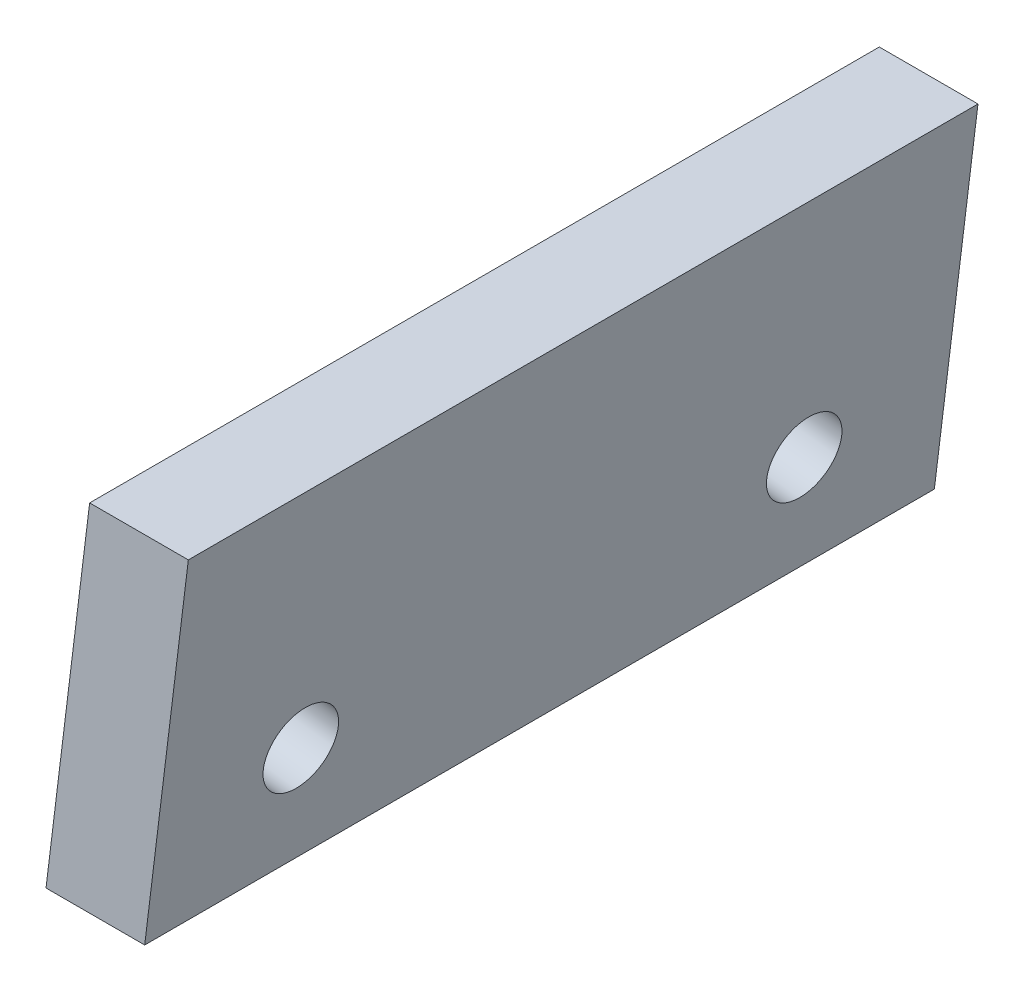
ISO-10303-21;
HEADER;
FILE_DESCRIPTION(('STEP AP214'),'2;1');
FILE_NAME('part.step','',(''),(''),'','','');
FILE_SCHEMA(('AUTOMOTIVE_DESIGN { 1 0 10303 214 1 1 1 1 }'));
ENDSEC;
DATA;
#1=APPLICATION_CONTEXT('core data for automotive mechanical design processes');
#2=APPLICATION_PROTOCOL_DEFINITION('international standard','automotive_design',2000,#1);
#3=PRODUCT_CONTEXT('',#1,'mechanical');
#4=PRODUCT('Part','Part','',(#3));
#5=PRODUCT_RELATED_PRODUCT_CATEGORY('part','',(#4));
#6=PRODUCT_DEFINITION_FORMATION('','',#4);
#7=PRODUCT_DEFINITION_CONTEXT('part definition',#1,'design');
#8=PRODUCT_DEFINITION('design','',#6,#7);
#9=PRODUCT_DEFINITION_SHAPE('','',#8);
#10=(LENGTH_UNIT() NAMED_UNIT(*) SI_UNIT(.MILLI.,.METRE.));
#11=(NAMED_UNIT(*) PLANE_ANGLE_UNIT() SI_UNIT($,.RADIAN.));
#12=(NAMED_UNIT(*) SI_UNIT($,.STERADIAN.) SOLID_ANGLE_UNIT());
#13=UNCERTAINTY_MEASURE_WITH_UNIT(LENGTH_MEASURE(1.E-05),#10,'distance_accuracy_value','');
#14=(GEOMETRIC_REPRESENTATION_CONTEXT(3) GLOBAL_UNCERTAINTY_ASSIGNED_CONTEXT((#13)) GLOBAL_UNIT_ASSIGNED_CONTEXT((#10,
#11,#12)) REPRESENTATION_CONTEXT('',''));
#15=CARTESIAN_POINT('',(0.,0.,0.));
#16=DIRECTION('',(0.,0.,1.));
#17=DIRECTION('',(1.,0.,0.));
#18=AXIS2_PLACEMENT_3D('',#15,#16,#17);
#19=CARTESIAN_POINT('',(0.,0.,20.));
#20=DIRECTION('',(0.992546151641322,-0.121869343405144,0.));
#21=DIRECTION('',(0.121869343405144,0.992546151641322,0.));
#22=AXIS2_PLACEMENT_3D('',#19,#20,#21);
#23=PLANE('',#22);
#24=CARTESIAN_POINT('',(0.365608030215432,2.97763845492397,3.625));
#25=DIRECTION('',(-0.992546151641322,0.121869343405144,0.));
#26=DIRECTION('',(-0.121869343405144,-0.992546151641322,0.));
#27=AXIS2_PLACEMENT_3D('',#24,#25,#26);
#28=CIRCLE('',#27,0.95);
#29=CARTESIAN_POINT('',(0.249832153980546,2.03471961086471,3.625));
#30=VERTEX_POINT('',#29);
#31=EDGE_CURVE('E108',#30,#30,#28,.T.);
#32=ORIENTED_EDGE('',*,*,#31,.F.);
#33=EDGE_LOOP('',(#32));
#34=FACE_BOUND('',#33,.T.);
#35=CARTESIAN_POINT('',(0.365608030215432,2.97763845492397,16.375));
#36=DIRECTION('',(-0.992546151641322,0.121869343405144,0.));
#37=DIRECTION('',(-0.121869343405144,-0.992546151641322,0.));
#38=AXIS2_PLACEMENT_3D('',#35,#36,#37);
#39=CIRCLE('',#38,0.950000000000001);
#40=CARTESIAN_POINT('',(0.249832153980545,2.03471961086471,16.375));
#41=VERTEX_POINT('',#40);
#42=EDGE_CURVE('E113',#41,#41,#39,.T.);
#43=ORIENTED_EDGE('',*,*,#42,.F.);
#44=EDGE_LOOP('',(#43));
#45=FACE_BOUND('',#44,.T.);
#46=DIRECTION('',(-0.121869343405144,-0.992546151641322,0.));
#47=VECTOR('',#46,1.);
#48=CARTESIAN_POINT('',(0.,0.,0.));
#49=LINE('',#48,#47);
#50=CARTESIAN_POINT('',(1.10506104812611,9.,0.));
#51=VERTEX_POINT('',#50);
#52=CARTESIAN_POINT('',(0.,0.,0.));
#53=VERTEX_POINT('',#52);
#54=EDGE_CURVE('E99',#51,#53,#49,.T.);
#55=ORIENTED_EDGE('',*,*,#54,.T.);
#56=DIRECTION('',(0.,0.,-1.));
#57=VECTOR('',#56,1.);
#58=CARTESIAN_POINT('',(0.,0.,20.));
#59=LINE('',#58,#57);
#60=CARTESIAN_POINT('',(0.,0.,20.));
#61=VERTEX_POINT('',#60);
#62=EDGE_CURVE('E11',#61,#53,#59,.T.);
#63=ORIENTED_EDGE('',*,*,#62,.F.);
#64=DIRECTION('',(-0.121869343405144,-0.992546151641322,0.));
#65=VECTOR('',#64,1.);
#66=CARTESIAN_POINT('',(0.,0.,20.));
#67=LINE('',#66,#65);
#68=CARTESIAN_POINT('',(1.10506104812611,9.,20.));
#69=VERTEX_POINT('',#68);
#70=EDGE_CURVE('E86',#69,#61,#67,.T.);
#71=ORIENTED_EDGE('',*,*,#70,.F.);
#72=DIRECTION('',(0.,0.,-1.));
#73=VECTOR('',#72,1.);
#74=CARTESIAN_POINT('',(1.10506104812611,9.,20.));
#75=LINE('',#74,#73);
#76=EDGE_CURVE('E95',#69,#51,#75,.T.);
#77=ORIENTED_EDGE('',*,*,#76,.T.);
#78=EDGE_LOOP('',(#55,#63,#71,#77));
#79=FACE_BOUND('',#78,.T.);
#80=ADVANCED_FACE('F33',(#34,#45,#79),#23,.F.);
#81=CARTESIAN_POINT('',(0.,0.,20.));
#82=DIRECTION('',(0.,1.,0.));
#83=DIRECTION('',(0.,0.,1.));
#84=AXIS2_PLACEMENT_3D('',#81,#82,#83);
#85=PLANE('',#84);
#86=DIRECTION('',(1.,0.,0.));
#87=VECTOR('',#86,1.);
#88=CARTESIAN_POINT('',(0.,0.,0.));
#89=LINE('',#88,#87);
#90=CARTESIAN_POINT('',(2.5,0.,0.));
#91=VERTEX_POINT('',#90);
#92=EDGE_CURVE('E90',#53,#91,#89,.T.);
#93=ORIENTED_EDGE('',*,*,#92,.T.);
#94=DIRECTION('',(0.,0.,-1.));
#95=VECTOR('',#94,1.);
#96=CARTESIAN_POINT('',(2.5,0.,20.));
#97=LINE('',#96,#95);
#98=CARTESIAN_POINT('',(2.5,0.,20.));
#99=VERTEX_POINT('',#98);
#100=EDGE_CURVE('E42',#99,#91,#97,.T.);
#101=ORIENTED_EDGE('',*,*,#100,.F.);
#102=DIRECTION('',(1.,0.,0.));
#103=VECTOR('',#102,1.);
#104=CARTESIAN_POINT('',(0.,0.,20.));
#105=LINE('',#104,#103);
#106=EDGE_CURVE('E81',#61,#99,#105,.T.);
#107=ORIENTED_EDGE('',*,*,#106,.F.);
#108=ORIENTED_EDGE('',*,*,#62,.T.);
#109=EDGE_LOOP('',(#93,#101,#107,#108));
#110=FACE_BOUND('',#109,.T.);
#111=ADVANCED_FACE('F89',(#110),#85,.F.);
#112=CARTESIAN_POINT('',(2.5,0.,20.));
#113=DIRECTION('',(-0.992546151641323,0.121869343405144,0.));
#114=DIRECTION('',(-0.121869343405144,-0.992546151641323,0.));
#115=AXIS2_PLACEMENT_3D('',#112,#113,#114);
#116=PLANE('',#115);
#117=CARTESIAN_POINT('',(2.82847768806043,2.67523608542439,3.625));
#118=DIRECTION('',(-0.992546151641323,0.121869343405144,0.));
#119=DIRECTION('',(-0.121869343405144,-0.992546151641323,0.));
#120=AXIS2_PLACEMENT_3D('',#117,#118,#119);
#121=CIRCLE('',#120,0.95);
#122=CARTESIAN_POINT('',(2.71270181182554,1.73231724136513,3.625));
#123=VERTEX_POINT('',#122);
#124=EDGE_CURVE('E36',#123,#123,#121,.T.);
#125=ORIENTED_EDGE('',*,*,#124,.T.);
#126=EDGE_LOOP('',(#125));
#127=FACE_BOUND('',#126,.T.);
#128=CARTESIAN_POINT('',(2.82847768806043,2.67523608542439,16.375));
#129=DIRECTION('',(-0.992546151641323,0.121869343405144,0.));
#130=DIRECTION('',(-0.121869343405144,-0.992546151641323,0.));
#131=AXIS2_PLACEMENT_3D('',#128,#129,#130);
#132=CIRCLE('',#131,0.950000000000001);
#133=CARTESIAN_POINT('',(2.71270181182554,1.73231724136513,16.375));
#134=VERTEX_POINT('',#133);
#135=EDGE_CURVE('E106',#134,#134,#132,.T.);
#136=ORIENTED_EDGE('',*,*,#135,.T.);
#137=EDGE_LOOP('',(#136));
#138=FACE_BOUND('',#137,.T.);
#139=DIRECTION('',(0.121869343405144,0.992546151641323,0.));
#140=VECTOR('',#139,1.);
#141=CARTESIAN_POINT('',(2.5,0.,0.));
#142=LINE('',#141,#140);
#143=CARTESIAN_POINT('',(3.60506104812611,9.,0.));
#144=VERTEX_POINT('',#143);
#145=EDGE_CURVE('E68',#91,#144,#142,.T.);
#146=ORIENTED_EDGE('',*,*,#145,.T.);
#147=DIRECTION('',(0.,0.,-1.));
#148=VECTOR('',#147,1.);
#149=CARTESIAN_POINT('',(3.60506104812611,9.,20.));
#150=LINE('',#149,#148);
#151=CARTESIAN_POINT('',(3.60506104812611,9.,20.));
#152=VERTEX_POINT('',#151);
#153=EDGE_CURVE('E91',#152,#144,#150,.T.);
#154=ORIENTED_EDGE('',*,*,#153,.F.);
#155=DIRECTION('',(0.121869343405144,0.992546151641323,0.));
#156=VECTOR('',#155,1.);
#157=CARTESIAN_POINT('',(2.5,0.,20.));
#158=LINE('',#157,#156);
#159=EDGE_CURVE('E84',#99,#152,#158,.T.);
#160=ORIENTED_EDGE('',*,*,#159,.F.);
#161=ORIENTED_EDGE('',*,*,#100,.T.);
#162=EDGE_LOOP('',(#146,#154,#160,#161));
#163=FACE_BOUND('',#162,.T.);
#164=ADVANCED_FACE('F93',(#127,#138,#163),#116,.F.);
#165=CARTESIAN_POINT('',(3.60506104812611,9.,20.));
#166=DIRECTION('',(0.,-1.,0.));
#167=DIRECTION('',(1.,0.,0.));
#168=AXIS2_PLACEMENT_3D('',#165,#166,#167);
#169=PLANE('',#168);
#170=DIRECTION('',(-1.,0.,0.));
#171=VECTOR('',#170,1.);
#172=CARTESIAN_POINT('',(3.60506104812611,9.,0.));
#173=LINE('',#172,#171);
#174=EDGE_CURVE('E74',#144,#51,#173,.T.);
#175=ORIENTED_EDGE('',*,*,#174,.T.);
#176=ORIENTED_EDGE('',*,*,#76,.F.);
#177=DIRECTION('',(-1.,0.,0.));
#178=VECTOR('',#177,1.);
#179=CARTESIAN_POINT('',(3.60506104812611,9.,20.));
#180=LINE('',#179,#178);
#181=EDGE_CURVE('E51',#152,#69,#180,.T.);
#182=ORIENTED_EDGE('',*,*,#181,.F.);
#183=ORIENTED_EDGE('',*,*,#153,.T.);
#184=EDGE_LOOP('',(#175,#176,#182,#183));
#185=FACE_BOUND('',#184,.T.);
#186=ADVANCED_FACE('F138',(#185),#169,.F.);
#187=CARTESIAN_POINT('',(0.,0.,20.));
#188=DIRECTION('',(0.,0.,1.));
#189=DIRECTION('',(1.,0.,0.));
#190=AXIS2_PLACEMENT_3D('',#187,#188,#189);
#191=PLANE('',#190);
#192=ORIENTED_EDGE('',*,*,#70,.T.);
#193=ORIENTED_EDGE('',*,*,#106,.T.);
#194=ORIENTED_EDGE('',*,*,#159,.T.);
#195=ORIENTED_EDGE('',*,*,#181,.T.);
#196=EDGE_LOOP('',(#192,#193,#194,#195));
#197=FACE_BOUND('',#196,.T.);
#198=ADVANCED_FACE('F82',(#197),#191,.T.);
#199=CARTESIAN_POINT('',(0.,0.,0.));
#200=DIRECTION('',(0.,0.,1.));
#201=DIRECTION('',(1.,0.,0.));
#202=AXIS2_PLACEMENT_3D('',#199,#200,#201);
#203=PLANE('',#202);
#204=ORIENTED_EDGE('',*,*,#54,.F.);
#205=ORIENTED_EDGE('',*,*,#174,.F.);
#206=ORIENTED_EDGE('',*,*,#145,.F.);
#207=ORIENTED_EDGE('',*,*,#92,.F.);
#208=EDGE_LOOP('',(#204,#205,#206,#207));
#209=FACE_BOUND('',#208,.T.);
#210=ADVANCED_FACE('F129',(#209),#203,.F.);
#211=CARTESIAN_POINT('',(3.91712621825891,2.54156685366638,16.375));
#212=DIRECTION('',(-0.992546151641323,0.121869343405144,0.));
#213=DIRECTION('',(-0.121869343405144,-0.992546151641323,0.));
#214=AXIS2_PLACEMENT_3D('',#211,#212,#213);
#215=CYLINDRICAL_SURFACE('',#214,0.950000000000001);
#216=ORIENTED_EDGE('',*,*,#42,.T.);
#217=EDGE_LOOP('',(#216));
#218=FACE_BOUND('',#217,.T.);
#219=ORIENTED_EDGE('',*,*,#135,.F.);
#220=EDGE_LOOP('',(#219));
#221=FACE_BOUND('',#220,.T.);
#222=ADVANCED_FACE('F121',(#218,#221),#215,.F.);
#223=CARTESIAN_POINT('',(3.91712621825891,2.54156685366638,3.625));
#224=DIRECTION('',(-0.992546151641323,0.121869343405144,0.));
#225=DIRECTION('',(-0.121869343405144,-0.992546151641323,0.));
#226=AXIS2_PLACEMENT_3D('',#223,#224,#225);
#227=CYLINDRICAL_SURFACE('',#226,0.95);
#228=ORIENTED_EDGE('',*,*,#31,.T.);
#229=EDGE_LOOP('',(#228));
#230=FACE_BOUND('',#229,.T.);
#231=ORIENTED_EDGE('',*,*,#124,.F.);
#232=EDGE_LOOP('',(#231));
#233=FACE_BOUND('',#232,.T.);
#234=ADVANCED_FACE('F136',(#230,#233),#227,.F.);
#235=CLOSED_SHELL('',(#80,#111,#164,#186,#198,#210,#222,#234));
#236=MANIFOLD_SOLID_BREP('B2',#235);
#237=ADVANCED_BREP_SHAPE_REPRESENTATION('',(#18,#236),#14);
#238=SHAPE_DEFINITION_REPRESENTATION(#9,#237);
ENDSEC;
END-ISO-10303-21;
